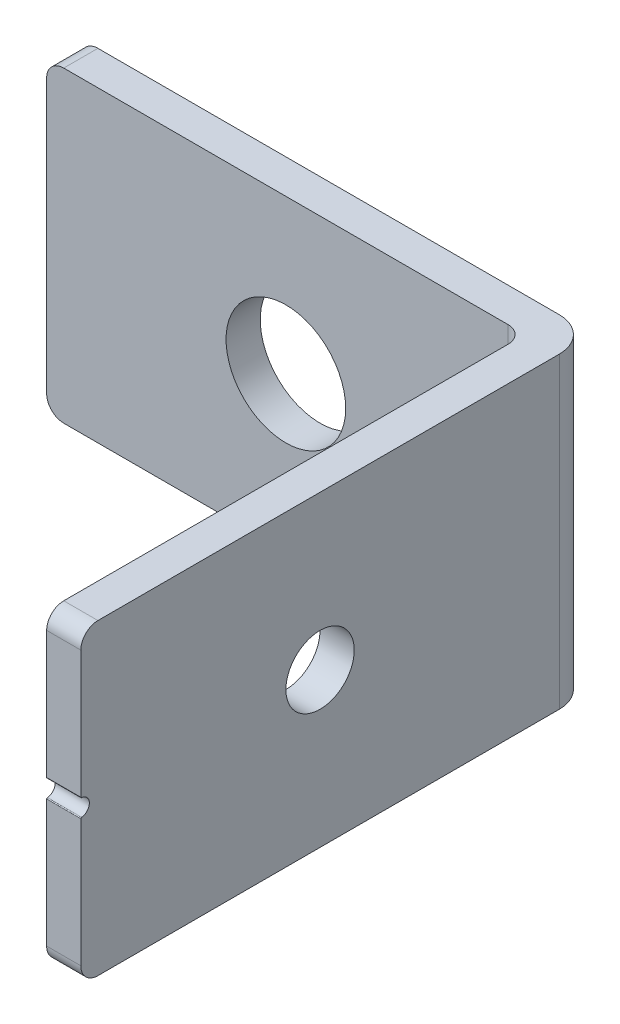
ISO-10303-21;
HEADER;
FILE_DESCRIPTION(('STEP AP214'),'2;1');
FILE_NAME('part.step','',(''),(''),'','','');
FILE_SCHEMA(('AUTOMOTIVE_DESIGN { 1 0 10303 214 1 1 1 1 }'));
ENDSEC;
DATA;
#1=APPLICATION_CONTEXT('core data for automotive mechanical design processes');
#2=APPLICATION_PROTOCOL_DEFINITION('international standard','automotive_design',2000,#1);
#3=PRODUCT_CONTEXT('',#1,'mechanical');
#4=PRODUCT('Part','Part','',(#3));
#5=PRODUCT_RELATED_PRODUCT_CATEGORY('part','',(#4));
#6=PRODUCT_DEFINITION_FORMATION('','',#4);
#7=PRODUCT_DEFINITION_CONTEXT('part definition',#1,'design');
#8=PRODUCT_DEFINITION('design','',#6,#7);
#9=PRODUCT_DEFINITION_SHAPE('','',#8);
#10=(LENGTH_UNIT() NAMED_UNIT(*) SI_UNIT(.MILLI.,.METRE.));
#11=(NAMED_UNIT(*) PLANE_ANGLE_UNIT() SI_UNIT($,.RADIAN.));
#12=(NAMED_UNIT(*) SI_UNIT($,.STERADIAN.) SOLID_ANGLE_UNIT());
#13=UNCERTAINTY_MEASURE_WITH_UNIT(LENGTH_MEASURE(1.E-05),#10,'distance_accuracy_value','');
#14=(GEOMETRIC_REPRESENTATION_CONTEXT(3) GLOBAL_UNCERTAINTY_ASSIGNED_CONTEXT((#13)) GLOBAL_UNIT_ASSIGNED_CONTEXT((#10,
#11,#12)) REPRESENTATION_CONTEXT('',''));
#15=CARTESIAN_POINT('',(0.,0.,0.));
#16=DIRECTION('',(0.,0.,1.));
#17=DIRECTION('',(1.,0.,0.));
#18=AXIS2_PLACEMENT_3D('',#15,#16,#17);
#19=CARTESIAN_POINT('',(25.348137020763,-15.23916015625,-30.));
#20=DIRECTION('',(-1.,0.,0.));
#21=DIRECTION('',(0.,0.,1.));
#22=AXIS2_PLACEMENT_3D('',#19,#20,#21);
#23=PLANE('',#22);
#24=CARTESIAN_POINT('',(25.348137020763,2.76083984375001,1.99999999999999));
#25=DIRECTION('',(-1.,0.,0.));
#26=DIRECTION('',(0.,0.,1.));
#27=AXIS2_PLACEMENT_3D('',#24,#25,#26);
#28=CIRCLE('',#27,4.);
#29=CARTESIAN_POINT('',(25.348137020763,2.76083984375001,5.99999999999999));
#30=VERTEX_POINT('',#29);
#31=EDGE_CURVE('E489',#30,#30,#28,.T.);
#32=ORIENTED_EDGE('',*,*,#31,.F.);
#33=EDGE_LOOP('',(#32));
#34=FACE_BOUND('',#33,.T.);
#35=DIRECTION('',(0.,-1.,0.));
#36=VECTOR('',#35,1.);
#37=CARTESIAN_POINT('',(25.348137020763,-15.23916015625,30.));
#38=LINE('',#37,#36);
#39=CARTESIAN_POINT('',(25.348137020763,1.66539472873947,30.));
#40=VERTEX_POINT('',#39);
#41=CARTESIAN_POINT('',(25.348137020763,-13.23916015625,30.));
#42=VERTEX_POINT('',#41);
#43=EDGE_CURVE('E226',#40,#42,#38,.T.);
#44=ORIENTED_EDGE('',*,*,#43,.F.);
#45=CARTESIAN_POINT('',(25.348137020763,1.66539472873947,29.9));
#46=DIRECTION('',(-1.,0.,0.));
#47=DIRECTION('',(0.,0.,1.));
#48=AXIS2_PLACEMENT_3D('',#45,#46,#47);
#49=CIRCLE('',#48,0.1);
#50=CARTESIAN_POINT('',(25.348137020763,1.76498064828587,29.9090909090909));
#51=VERTEX_POINT('',#50);
#52=EDGE_CURVE('E24',#40,#51,#49,.T.);
#53=ORIENTED_EDGE('',*,*,#52,.T.);
#54=CARTESIAN_POINT('',(25.348137020763,2.76083984375,30.));
#55=DIRECTION('',(-1.,0.,0.));
#56=DIRECTION('',(0.,0.,1.));
#57=AXIS2_PLACEMENT_3D('',#54,#55,#56);
#58=CIRCLE('',#57,1.0000000000002);
#59=CARTESIAN_POINT('',(25.348137020763,3.75669903921414,29.9090909090909));
#60=VERTEX_POINT('',#59);
#61=EDGE_CURVE('E225',#51,#60,#58,.F.);
#62=ORIENTED_EDGE('',*,*,#61,.T.);
#63=CARTESIAN_POINT('',(25.348137020763,3.85628495876053,29.9));
#64=DIRECTION('',(-1.,0.,0.));
#65=DIRECTION('',(0.,0.,1.));
#66=AXIS2_PLACEMENT_3D('',#63,#64,#65);
#67=CIRCLE('',#66,0.1);
#68=CARTESIAN_POINT('',(25.348137020763,3.85628495876053,30.));
#69=VERTEX_POINT('',#68);
#70=EDGE_CURVE('E31',#60,#69,#67,.T.);
#71=ORIENTED_EDGE('',*,*,#70,.T.);
#72=CARTESIAN_POINT('',(25.348137020763,18.76083984375,30.));
#73=VERTEX_POINT('',#72);
#74=EDGE_CURVE('E249',#73,#69,#38,.T.);
#75=ORIENTED_EDGE('',*,*,#74,.F.);
#76=CARTESIAN_POINT('',(25.348137020763,18.76083984375,28.));
#77=DIRECTION('',(-1.,0.,0.));
#78=DIRECTION('',(0.,0.,1.));
#79=AXIS2_PLACEMENT_3D('',#76,#77,#78);
#80=CIRCLE('',#79,2.);
#81=CARTESIAN_POINT('',(25.348137020763,20.76083984375,28.));
#82=VERTEX_POINT('',#81);
#83=EDGE_CURVE('E176',#73,#82,#80,.T.);
#84=ORIENTED_EDGE('',*,*,#83,.T.);
#85=DIRECTION('',(0.,0.,1.));
#86=VECTOR('',#85,1.);
#87=CARTESIAN_POINT('',(25.348137020763,20.76083984375,30.));
#88=LINE('',#87,#86);
#89=CARTESIAN_POINT('',(25.348137020763,20.76083984375,-24.));
#90=VERTEX_POINT('',#89);
#91=EDGE_CURVE('E245',#90,#82,#88,.T.);
#92=ORIENTED_EDGE('',*,*,#91,.F.);
#93=DIRECTION('',(0.,1.,0.));
#94=VECTOR('',#93,1.);
#95=CARTESIAN_POINT('',(25.348137020763,-15.23916015625,-24.));
#96=LINE('',#95,#94);
#97=CARTESIAN_POINT('',(25.348137020763,-15.23916015625,-24.));
#98=VERTEX_POINT('',#97);
#99=EDGE_CURVE('E181',#90,#98,#96,.F.);
#100=ORIENTED_EDGE('',*,*,#99,.T.);
#101=DIRECTION('',(0.,0.,-1.));
#102=VECTOR('',#101,1.);
#103=CARTESIAN_POINT('',(25.348137020763,-15.23916015625,-30.));
#104=LINE('',#103,#102);
#105=CARTESIAN_POINT('',(25.348137020763,-15.23916015625,28.));
#106=VERTEX_POINT('',#105);
#107=EDGE_CURVE('E241',#106,#98,#104,.T.);
#108=ORIENTED_EDGE('',*,*,#107,.F.);
#109=CARTESIAN_POINT('',(25.348137020763,-13.23916015625,28.));
#110=DIRECTION('',(-1.,0.,0.));
#111=DIRECTION('',(0.,0.,1.));
#112=AXIS2_PLACEMENT_3D('',#109,#110,#111);
#113=CIRCLE('',#112,2.);
#114=EDGE_CURVE('E178',#106,#42,#113,.T.);
#115=ORIENTED_EDGE('',*,*,#114,.T.);
#116=EDGE_LOOP('',(#44,#53,#62,#71,#75,#84,#92,#100,#108,#115));
#117=FACE_BOUND('',#116,.T.);
#118=ADVANCED_FACE('F16',(#34,#117),#23,.T.);
#119=CARTESIAN_POINT('',(29.348137020763,-15.23916015625,30.));
#120=DIRECTION('',(0.,0.,-1.));
#121=DIRECTION('',(-1.,0.,0.));
#122=AXIS2_PLACEMENT_3D('',#119,#120,#121);
#123=PLANE('',#122);
#124=ORIENTED_EDGE('',*,*,#74,.T.);
#125=DIRECTION('',(-1.,0.,0.));
#126=VECTOR('',#125,1.);
#127=CARTESIAN_POINT('',(29.348137020763,3.85628495876053,30.));
#128=LINE('',#127,#126);
#129=CARTESIAN_POINT('',(29.348137020763,3.85628495876053,30.));
#130=VERTEX_POINT('',#129);
#131=EDGE_CURVE('E10',#69,#130,#128,.F.);
#132=ORIENTED_EDGE('',*,*,#131,.T.);
#133=DIRECTION('',(0.,-1.,0.));
#134=VECTOR('',#133,1.);
#135=CARTESIAN_POINT('',(29.348137020763,-15.23916015625,30.));
#136=LINE('',#135,#134);
#137=CARTESIAN_POINT('',(29.348137020763,18.76083984375,30.));
#138=VERTEX_POINT('',#137);
#139=EDGE_CURVE('E146',#138,#130,#136,.T.);
#140=ORIENTED_EDGE('',*,*,#139,.F.);
#141=DIRECTION('',(-1.,0.,0.));
#142=VECTOR('',#141,1.);
#143=CARTESIAN_POINT('',(29.348137020763,18.76083984375,30.));
#144=LINE('',#143,#142);
#145=EDGE_CURVE('E193',#138,#73,#144,.T.);
#146=ORIENTED_EDGE('',*,*,#145,.T.);
#147=EDGE_LOOP('',(#124,#132,#140,#146));
#148=FACE_BOUND('',#147,.T.);
#149=ADVANCED_FACE('F313',(#148),#123,.F.);
#150=CARTESIAN_POINT('',(29.348137020763,1.66539472873947,30.));
#151=VERTEX_POINT('',#150);
#152=CARTESIAN_POINT('',(29.348137020763,-13.23916015625,30.));
#153=VERTEX_POINT('',#152);
#154=EDGE_CURVE('E235',#151,#153,#136,.T.);
#155=ORIENTED_EDGE('',*,*,#154,.F.);
#156=DIRECTION('',(-1.,0.,0.));
#157=VECTOR('',#156,1.);
#158=CARTESIAN_POINT('',(25.348137020763,1.66539472873947,30.));
#159=LINE('',#158,#157);
#160=EDGE_CURVE('E39',#151,#40,#159,.T.);
#161=ORIENTED_EDGE('',*,*,#160,.T.);
#162=ORIENTED_EDGE('',*,*,#43,.T.);
#163=DIRECTION('',(-1.,0.,0.));
#164=VECTOR('',#163,1.);
#165=CARTESIAN_POINT('',(29.348137020763,-13.23916015625,30.));
#166=LINE('',#165,#164);
#167=EDGE_CURVE('E187',#42,#153,#166,.F.);
#168=ORIENTED_EDGE('',*,*,#167,.T.);
#169=EDGE_LOOP('',(#155,#161,#162,#168));
#170=FACE_BOUND('',#169,.T.);
#171=ADVANCED_FACE('F236',(#170),#123,.F.);
#172=CARTESIAN_POINT('',(29.348137020763,-15.23916015625,-30.));
#173=DIRECTION('',(-1.,0.,0.));
#174=DIRECTION('',(0.,0.,1.));
#175=AXIS2_PLACEMENT_3D('',#172,#173,#174);
#176=PLANE('',#175);
#177=CARTESIAN_POINT('',(29.348137020763,2.76083984375001,1.99999999999999));
#178=DIRECTION('',(-1.,0.,0.));
#179=DIRECTION('',(0.,0.,1.));
#180=AXIS2_PLACEMENT_3D('',#177,#178,#179);
#181=CIRCLE('',#180,4.);
#182=CARTESIAN_POINT('',(29.348137020763,2.76083984375001,5.99999999999999));
#183=VERTEX_POINT('',#182);
#184=EDGE_CURVE('E248',#183,#183,#181,.T.);
#185=ORIENTED_EDGE('',*,*,#184,.T.);
#186=EDGE_LOOP('',(#185));
#187=FACE_BOUND('',#186,.T.);
#188=CARTESIAN_POINT('',(29.348137020763,2.76083984375,30.));
#189=DIRECTION('',(-1.,0.,0.));
#190=DIRECTION('',(0.,0.,1.));
#191=AXIS2_PLACEMENT_3D('',#188,#189,#190);
#192=CIRCLE('',#191,1.0000000000002);
#193=CARTESIAN_POINT('',(29.348137020763,1.76498064828587,29.9090909090909));
#194=VERTEX_POINT('',#193);
#195=CARTESIAN_POINT('',(29.348137020763,3.75669903921414,29.9090909090909));
#196=VERTEX_POINT('',#195);
#197=EDGE_CURVE('E161',#194,#196,#192,.F.);
#198=ORIENTED_EDGE('',*,*,#197,.F.);
#199=CARTESIAN_POINT('',(29.348137020763,1.66539472873947,29.9));
#200=DIRECTION('',(-1.,0.,0.));
#201=DIRECTION('',(0.,0.,1.));
#202=AXIS2_PLACEMENT_3D('',#199,#200,#201);
#203=CIRCLE('',#202,0.1);
#204=EDGE_CURVE('E220',#194,#151,#203,.F.);
#205=ORIENTED_EDGE('',*,*,#204,.T.);
#206=ORIENTED_EDGE('',*,*,#154,.T.);
#207=CARTESIAN_POINT('',(29.348137020763,-13.23916015625,28.));
#208=DIRECTION('',(-1.,0.,0.));
#209=DIRECTION('',(0.,0.,1.));
#210=AXIS2_PLACEMENT_3D('',#207,#208,#209);
#211=CIRCLE('',#210,2.);
#212=CARTESIAN_POINT('',(29.348137020763,-15.23916015625,28.));
#213=VERTEX_POINT('',#212);
#214=EDGE_CURVE('E141',#153,#213,#211,.F.);
#215=ORIENTED_EDGE('',*,*,#214,.T.);
#216=DIRECTION('',(0.,0.,-1.));
#217=VECTOR('',#216,1.);
#218=CARTESIAN_POINT('',(29.348137020763,-15.23916015625,-30.));
#219=LINE('',#218,#217);
#220=CARTESIAN_POINT('',(29.348137020763,-15.23916015625,-26.));
#221=VERTEX_POINT('',#220);
#222=EDGE_CURVE('E132',#213,#221,#219,.T.);
#223=ORIENTED_EDGE('',*,*,#222,.T.);
#224=DIRECTION('',(0.,1.,0.));
#225=VECTOR('',#224,1.);
#226=CARTESIAN_POINT('',(29.348137020763,20.76083984375,-26.));
#227=LINE('',#226,#225);
#228=CARTESIAN_POINT('',(29.348137020763,20.76083984375,-26.));
#229=VERTEX_POINT('',#228);
#230=EDGE_CURVE('E138',#221,#229,#227,.T.);
#231=ORIENTED_EDGE('',*,*,#230,.T.);
#232=DIRECTION('',(0.,0.,1.));
#233=VECTOR('',#232,1.);
#234=CARTESIAN_POINT('',(29.348137020763,20.76083984375,30.));
#235=LINE('',#234,#233);
#236=CARTESIAN_POINT('',(29.348137020763,20.76083984375,28.));
#237=VERTEX_POINT('',#236);
#238=EDGE_CURVE('E238',#229,#237,#235,.T.);
#239=ORIENTED_EDGE('',*,*,#238,.T.);
#240=CARTESIAN_POINT('',(29.348137020763,18.76083984375,28.));
#241=DIRECTION('',(-1.,0.,0.));
#242=DIRECTION('',(0.,0.,1.));
#243=AXIS2_PLACEMENT_3D('',#240,#241,#242);
#244=CIRCLE('',#243,2.);
#245=EDGE_CURVE('E190',#237,#138,#244,.F.);
#246=ORIENTED_EDGE('',*,*,#245,.T.);
#247=ORIENTED_EDGE('',*,*,#139,.T.);
#248=CARTESIAN_POINT('',(29.348137020763,3.85628495876053,29.9));
#249=DIRECTION('',(-1.,0.,0.));
#250=DIRECTION('',(0.,0.,1.));
#251=AXIS2_PLACEMENT_3D('',#248,#249,#250);
#252=CIRCLE('',#251,0.1);
#253=EDGE_CURVE('E218',#130,#196,#252,.F.);
#254=ORIENTED_EDGE('',*,*,#253,.T.);
#255=EDGE_LOOP('',(#198,#205,#206,#215,#223,#231,#239,#246,#247,#254));
#256=FACE_BOUND('',#255,.T.);
#257=ADVANCED_FACE('F135',(#187,#256),#176,.F.);
#258=CARTESIAN_POINT('',(25.348137020763,-15.23916015625,-26.));
#259=DIRECTION('',(0.,1.,0.));
#260=DIRECTION('',(-1.,0.,0.));
#261=AXIS2_PLACEMENT_3D('',#258,#259,#260);
#262=PLANE('',#261);
#263=ORIENTED_EDGE('',*,*,#222,.F.);
#264=DIRECTION('',(-1.,0.,0.));
#265=VECTOR('',#264,1.);
#266=CARTESIAN_POINT('',(25.348137020763,-15.23916015625,28.));
#267=LINE('',#266,#265);
#268=EDGE_CURVE('E185',#213,#106,#267,.T.);
#269=ORIENTED_EDGE('',*,*,#268,.T.);
#270=ORIENTED_EDGE('',*,*,#107,.T.);
#271=CARTESIAN_POINT('',(23.348137020763,-15.23916015625,-24.));
#272=DIRECTION('',(0.,1.,0.));
#273=DIRECTION('',(-1.,0.,0.));
#274=AXIS2_PLACEMENT_3D('',#271,#272,#273);
#275=CIRCLE('',#274,2.);
#276=CARTESIAN_POINT('',(23.348137020763,-15.23916015625,-26.));
#277=VERTEX_POINT('',#276);
#278=EDGE_CURVE('E211',#98,#277,#275,.T.);
#279=ORIENTED_EDGE('',*,*,#278,.T.);
#280=DIRECTION('',(1.,0.,0.));
#281=VECTOR('',#280,1.);
#282=CARTESIAN_POINT('',(25.348137020763,-15.23916015625,-26.));
#283=LINE('',#282,#281);
#284=CARTESIAN_POINT('',(-28.651862979237,-15.23916015625,-26.));
#285=VERTEX_POINT('',#284);
#286=EDGE_CURVE('E253',#285,#277,#283,.T.);
#287=ORIENTED_EDGE('',*,*,#286,.F.);
#288=DIRECTION('',(0.,0.,-1.));
#289=VECTOR('',#288,1.);
#290=CARTESIAN_POINT('',(-28.651862979237,-15.23916015625,-26.));
#291=LINE('',#290,#289);
#292=CARTESIAN_POINT('',(-28.651862979237,-15.23916015625,-30.));
#293=VERTEX_POINT('',#292);
#294=EDGE_CURVE('E183',#285,#293,#291,.T.);
#295=ORIENTED_EDGE('',*,*,#294,.T.);
#296=DIRECTION('',(1.,0.,0.));
#297=VECTOR('',#296,1.);
#298=CARTESIAN_POINT('',(25.348137020763,-15.23916015625,-30.));
#299=LINE('',#298,#297);
#300=CARTESIAN_POINT('',(25.348137020763,-15.23916015625,-30.));
#301=VERTEX_POINT('',#300);
#302=EDGE_CURVE('E145',#293,#301,#299,.T.);
#303=ORIENTED_EDGE('',*,*,#302,.T.);
#304=CARTESIAN_POINT('',(25.348137020763,-15.23916015625,-26.));
#305=DIRECTION('',(0.,1.,0.));
#306=DIRECTION('',(-1.,0.,0.));
#307=AXIS2_PLACEMENT_3D('',#304,#305,#306);
#308=CIRCLE('',#307,4.);
#309=EDGE_CURVE('E149',#301,#221,#308,.F.);
#310=ORIENTED_EDGE('',*,*,#309,.T.);
#311=EDGE_LOOP('',(#263,#269,#270,#279,#287,#295,#303,#310));
#312=FACE_BOUND('',#311,.T.);
#313=ADVANCED_FACE('F150',(#312),#262,.F.);
#314=CARTESIAN_POINT('',(-30.651862979237,20.76083984375,-26.));
#315=DIRECTION('',(0.,-1.,0.));
#316=DIRECTION('',(0.,0.,-1.));
#317=AXIS2_PLACEMENT_3D('',#314,#315,#316);
#318=PLANE('',#317);
#319=ORIENTED_EDGE('',*,*,#91,.T.);
#320=DIRECTION('',(-1.,0.,0.));
#321=VECTOR('',#320,1.);
#322=CARTESIAN_POINT('',(-30.651862979237,20.76083984375,28.));
#323=LINE('',#322,#321);
#324=EDGE_CURVE('E198',#82,#237,#323,.F.);
#325=ORIENTED_EDGE('',*,*,#324,.T.);
#326=ORIENTED_EDGE('',*,*,#238,.F.);
#327=CARTESIAN_POINT('',(25.348137020763,20.76083984375,-26.));
#328=DIRECTION('',(0.,-1.,0.));
#329=DIRECTION('',(0.,0.,-1.));
#330=AXIS2_PLACEMENT_3D('',#327,#328,#329);
#331=CIRCLE('',#330,4.);
#332=CARTESIAN_POINT('',(25.348137020763,20.76083984375,-30.));
#333=VERTEX_POINT('',#332);
#334=EDGE_CURVE('E160',#229,#333,#331,.F.);
#335=ORIENTED_EDGE('',*,*,#334,.T.);
#336=DIRECTION('',(-1.,0.,0.));
#337=VECTOR('',#336,1.);
#338=CARTESIAN_POINT('',(-30.651862979237,20.76083984375,-30.));
#339=LINE('',#338,#337);
#340=CARTESIAN_POINT('',(-28.651862979237,20.76083984375,-30.));
#341=VERTEX_POINT('',#340);
#342=EDGE_CURVE('E263',#333,#341,#339,.T.);
#343=ORIENTED_EDGE('',*,*,#342,.T.);
#344=DIRECTION('',(0.,0.,-1.));
#345=VECTOR('',#344,1.);
#346=CARTESIAN_POINT('',(-28.651862979237,20.76083984375,-26.));
#347=LINE('',#346,#345);
#348=CARTESIAN_POINT('',(-28.651862979237,20.76083984375,-26.));
#349=VERTEX_POINT('',#348);
#350=EDGE_CURVE('E196',#341,#349,#347,.F.);
#351=ORIENTED_EDGE('',*,*,#350,.T.);
#352=DIRECTION('',(-1.,0.,0.));
#353=VECTOR('',#352,1.);
#354=CARTESIAN_POINT('',(-30.651862979237,20.76083984375,-26.));
#355=LINE('',#354,#353);
#356=CARTESIAN_POINT('',(23.348137020763,20.76083984375,-26.));
#357=VERTEX_POINT('',#356);
#358=EDGE_CURVE('E256',#357,#349,#355,.T.);
#359=ORIENTED_EDGE('',*,*,#358,.F.);
#360=CARTESIAN_POINT('',(23.348137020763,20.76083984375,-24.));
#361=DIRECTION('',(0.,-1.,0.));
#362=DIRECTION('',(0.,0.,-1.));
#363=AXIS2_PLACEMENT_3D('',#360,#361,#362);
#364=CIRCLE('',#363,2.);
#365=EDGE_CURVE('E209',#357,#90,#364,.T.);
#366=ORIENTED_EDGE('',*,*,#365,.T.);
#367=EDGE_LOOP('',(#319,#325,#326,#335,#343,#351,#359,#366));
#368=FACE_BOUND('',#367,.T.);
#369=ADVANCED_FACE('F289',(#368),#318,.F.);
#370=CARTESIAN_POINT('',(-30.651862979237,-15.23916015625,-26.));
#371=DIRECTION('',(1.,0.,0.));
#372=DIRECTION('',(0.,0.,-1.));
#373=AXIS2_PLACEMENT_3D('',#370,#371,#372);
#374=PLANE('',#373);
#375=DIRECTION('',(0.,-1.,0.));
#376=VECTOR('',#375,1.);
#377=CARTESIAN_POINT('',(-30.651862979237,-15.23916015625,-26.));
#378=LINE('',#377,#376);
#379=CARTESIAN_POINT('',(-30.651862979237,18.76083984375,-26.));
#380=VERTEX_POINT('',#379);
#381=CARTESIAN_POINT('',(-30.651862979237,-13.23916015625,-26.));
#382=VERTEX_POINT('',#381);
#383=EDGE_CURVE('E165',#380,#382,#378,.T.);
#384=ORIENTED_EDGE('',*,*,#383,.F.);
#385=DIRECTION('',(0.,0.,-1.));
#386=VECTOR('',#385,1.);
#387=CARTESIAN_POINT('',(-30.651862979237,18.76083984375,-26.));
#388=LINE('',#387,#386);
#389=CARTESIAN_POINT('',(-30.651862979237,18.76083984375,-30.));
#390=VERTEX_POINT('',#389);
#391=EDGE_CURVE('E202',#380,#390,#388,.T.);
#392=ORIENTED_EDGE('',*,*,#391,.T.);
#393=DIRECTION('',(0.,-1.,0.));
#394=VECTOR('',#393,1.);
#395=CARTESIAN_POINT('',(-30.651862979237,-15.23916015625,-30.));
#396=LINE('',#395,#394);
#397=CARTESIAN_POINT('',(-30.651862979237,-13.23916015625,-30.));
#398=VERTEX_POINT('',#397);
#399=EDGE_CURVE('E257',#390,#398,#396,.T.);
#400=ORIENTED_EDGE('',*,*,#399,.T.);
#401=DIRECTION('',(0.,0.,-1.));
#402=VECTOR('',#401,1.);
#403=CARTESIAN_POINT('',(-30.651862979237,-13.23916015625,-26.));
#404=LINE('',#403,#402);
#405=EDGE_CURVE('E200',#398,#382,#404,.F.);
#406=ORIENTED_EDGE('',*,*,#405,.T.);
#407=EDGE_LOOP('',(#384,#392,#400,#406));
#408=FACE_BOUND('',#407,.T.);
#409=ADVANCED_FACE('F270',(#408),#374,.F.);
#410=CARTESIAN_POINT('',(-30.651862979237,-15.23916015625,-26.));
#411=DIRECTION('',(0.,0.,-1.));
#412=DIRECTION('',(-1.,0.,0.));
#413=AXIS2_PLACEMENT_3D('',#410,#411,#412);
#414=PLANE('',#413);
#415=CARTESIAN_POINT('',(-2.65186297923697,2.76083984375,-26.));
#416=DIRECTION('',(0.,0.,1.));
#417=DIRECTION('',(1.,0.,0.));
#418=AXIS2_PLACEMENT_3D('',#415,#416,#417);
#419=CIRCLE('',#418,7.00000000000001);
#420=CARTESIAN_POINT('',(4.34813702076304,2.76083984375,-26.));
#421=VERTEX_POINT('',#420);
#422=EDGE_CURVE('E232',#421,#421,#419,.T.);
#423=ORIENTED_EDGE('',*,*,#422,.F.);
#424=EDGE_LOOP('',(#423));
#425=FACE_BOUND('',#424,.T.);
#426=ORIENTED_EDGE('',*,*,#286,.T.);
#427=DIRECTION('',(0.,1.,0.));
#428=VECTOR('',#427,1.);
#429=CARTESIAN_POINT('',(23.348137020763,-15.23916015625,-26.));
#430=LINE('',#429,#428);
#431=EDGE_CURVE('E173',#277,#357,#430,.T.);
#432=ORIENTED_EDGE('',*,*,#431,.T.);
#433=ORIENTED_EDGE('',*,*,#358,.T.);
#434=CARTESIAN_POINT('',(-28.651862979237,18.76083984375,-26.));
#435=DIRECTION('',(0.,0.,-1.));
#436=DIRECTION('',(-1.,0.,0.));
#437=AXIS2_PLACEMENT_3D('',#434,#435,#436);
#438=CIRCLE('',#437,2.);
#439=EDGE_CURVE('E171',#349,#380,#438,.F.);
#440=ORIENTED_EDGE('',*,*,#439,.T.);
#441=ORIENTED_EDGE('',*,*,#383,.T.);
#442=CARTESIAN_POINT('',(-28.651862979237,-13.23916015625,-26.));
#443=DIRECTION('',(0.,0.,-1.));
#444=DIRECTION('',(-1.,0.,0.));
#445=AXIS2_PLACEMENT_3D('',#442,#443,#444);
#446=CIRCLE('',#445,2.);
#447=EDGE_CURVE('E156',#382,#285,#446,.F.);
#448=ORIENTED_EDGE('',*,*,#447,.T.);
#449=EDGE_LOOP('',(#426,#432,#433,#440,#441,#448));
#450=FACE_BOUND('',#449,.T.);
#451=ADVANCED_FACE('F279',(#425,#450),#414,.F.);
#452=CARTESIAN_POINT('',(-30.651862979237,-15.23916015625,-30.));
#453=DIRECTION('',(0.,0.,-1.));
#454=DIRECTION('',(-1.,0.,0.));
#455=AXIS2_PLACEMENT_3D('',#452,#453,#454);
#456=PLANE('',#455);
#457=CARTESIAN_POINT('',(-2.65186297923697,2.76083984375,-30.));
#458=DIRECTION('',(0.,0.,1.));
#459=DIRECTION('',(1.,0.,0.));
#460=AXIS2_PLACEMENT_3D('',#457,#458,#459);
#461=CIRCLE('',#460,7.00000000000001);
#462=CARTESIAN_POINT('',(4.34813702076304,2.76083984375,-30.));
#463=VERTEX_POINT('',#462);
#464=EDGE_CURVE('E485',#463,#463,#461,.T.);
#465=ORIENTED_EDGE('',*,*,#464,.T.);
#466=EDGE_LOOP('',(#465));
#467=FACE_BOUND('',#466,.T.);
#468=ORIENTED_EDGE('',*,*,#399,.F.);
#469=CARTESIAN_POINT('',(-28.651862979237,18.76083984375,-30.));
#470=DIRECTION('',(0.,0.,-1.));
#471=DIRECTION('',(-1.,0.,0.));
#472=AXIS2_PLACEMENT_3D('',#469,#470,#471);
#473=CIRCLE('',#472,2.);
#474=EDGE_CURVE('E207',#390,#341,#473,.T.);
#475=ORIENTED_EDGE('',*,*,#474,.T.);
#476=ORIENTED_EDGE('',*,*,#342,.F.);
#477=DIRECTION('',(0.,1.,0.));
#478=VECTOR('',#477,1.);
#479=CARTESIAN_POINT('',(25.348137020763,-15.23916015625,-30.));
#480=LINE('',#479,#478);
#481=EDGE_CURVE('E157',#333,#301,#480,.F.);
#482=ORIENTED_EDGE('',*,*,#481,.T.);
#483=ORIENTED_EDGE('',*,*,#302,.F.);
#484=CARTESIAN_POINT('',(-28.651862979237,-13.23916015625,-30.));
#485=DIRECTION('',(0.,0.,-1.));
#486=DIRECTION('',(-1.,0.,0.));
#487=AXIS2_PLACEMENT_3D('',#484,#485,#486);
#488=CIRCLE('',#487,2.);
#489=EDGE_CURVE('E205',#293,#398,#488,.T.);
#490=ORIENTED_EDGE('',*,*,#489,.T.);
#491=EDGE_LOOP('',(#468,#475,#476,#482,#483,#490));
#492=FACE_BOUND('',#491,.T.);
#493=ADVANCED_FACE('F295',(#467,#492),#456,.T.);
#494=CARTESIAN_POINT('',(29.348137020763,2.76083984375001,1.99999999999999));
#495=DIRECTION('',(-1.,0.,0.));
#496=DIRECTION('',(0.,0.,1.));
#497=AXIS2_PLACEMENT_3D('',#494,#495,#496);
#498=CYLINDRICAL_SURFACE('',#497,4.);
#499=ORIENTED_EDGE('',*,*,#184,.F.);
#500=EDGE_LOOP('',(#499));
#501=FACE_BOUND('',#500,.T.);
#502=ORIENTED_EDGE('',*,*,#31,.T.);
#503=EDGE_LOOP('',(#502));
#504=FACE_BOUND('',#503,.T.);
#505=ADVANCED_FACE('F297',(#501,#504),#498,.F.);
#506=CARTESIAN_POINT('',(-2.65186297923697,2.76083984375,-30.));
#507=DIRECTION('',(0.,0.,1.));
#508=DIRECTION('',(1.,0.,0.));
#509=AXIS2_PLACEMENT_3D('',#506,#507,#508);
#510=CYLINDRICAL_SURFACE('',#509,7.00000000000001);
#511=ORIENTED_EDGE('',*,*,#464,.F.);
#512=EDGE_LOOP('',(#511));
#513=FACE_BOUND('',#512,.T.);
#514=ORIENTED_EDGE('',*,*,#422,.T.);
#515=EDGE_LOOP('',(#514));
#516=FACE_BOUND('',#515,.T.);
#517=ADVANCED_FACE('F305',(#513,#516),#510,.F.);
#518=CARTESIAN_POINT('',(-94.8690491972661,2.76083984375,30.));
#519=DIRECTION('',(1.,0.,0.));
#520=DIRECTION('',(0.,0.,-1.));
#521=AXIS2_PLACEMENT_3D('',#518,#519,#520);
#522=CYLINDRICAL_SURFACE('',#521,1.0000000000002);
#523=ORIENTED_EDGE('',*,*,#61,.F.);
#524=DIRECTION('',(1.,0.,0.));
#525=VECTOR('',#524,1.);
#526=CARTESIAN_POINT('',(-94.8690491972661,1.76498064828587,29.9090909090909));
#527=LINE('',#526,#525);
#528=EDGE_CURVE('E215',#51,#194,#527,.T.);
#529=ORIENTED_EDGE('',*,*,#528,.T.);
#530=ORIENTED_EDGE('',*,*,#197,.T.);
#531=DIRECTION('',(1.,0.,0.));
#532=VECTOR('',#531,1.);
#533=CARTESIAN_POINT('',(-94.8690491972661,3.75669903921414,29.9090909090909));
#534=LINE('',#533,#532);
#535=EDGE_CURVE('E213',#196,#60,#534,.F.);
#536=ORIENTED_EDGE('',*,*,#535,.T.);
#537=EDGE_LOOP('',(#523,#529,#530,#536));
#538=FACE_BOUND('',#537,.T.);
#539=ADVANCED_FACE('F230',(#538),#522,.F.);
#540=CARTESIAN_POINT('',(25.348137020763,-15.23916015625,-26.));
#541=DIRECTION('',(0.,-1.,0.));
#542=DIRECTION('',(0.,0.,-1.));
#543=AXIS2_PLACEMENT_3D('',#540,#541,#542);
#544=CYLINDRICAL_SURFACE('',#543,4.);
#545=ORIENTED_EDGE('',*,*,#309,.F.);
#546=ORIENTED_EDGE('',*,*,#481,.F.);
#547=ORIENTED_EDGE('',*,*,#334,.F.);
#548=ORIENTED_EDGE('',*,*,#230,.F.);
#549=EDGE_LOOP('',(#545,#546,#547,#548));
#550=FACE_BOUND('',#549,.T.);
#551=ADVANCED_FACE('F159',(#550),#544,.T.);
#552=CARTESIAN_POINT('',(23.348137020763,-15.23916015625,-24.));
#553=DIRECTION('',(0.,1.,0.));
#554=DIRECTION('',(0.,0.,1.));
#555=AXIS2_PLACEMENT_3D('',#552,#553,#554);
#556=CYLINDRICAL_SURFACE('',#555,2.);
#557=ORIENTED_EDGE('',*,*,#278,.F.);
#558=ORIENTED_EDGE('',*,*,#99,.F.);
#559=ORIENTED_EDGE('',*,*,#365,.F.);
#560=ORIENTED_EDGE('',*,*,#431,.F.);
#561=EDGE_LOOP('',(#557,#558,#559,#560));
#562=FACE_BOUND('',#561,.T.);
#563=ADVANCED_FACE('F285',(#562),#556,.F.);
#564=CARTESIAN_POINT('',(25.348137020763,-13.23916015625,28.));
#565=DIRECTION('',(-1.,0.,0.));
#566=DIRECTION('',(0.,-1.,0.));
#567=AXIS2_PLACEMENT_3D('',#564,#565,#566);
#568=CYLINDRICAL_SURFACE('',#567,2.);
#569=ORIENTED_EDGE('',*,*,#214,.F.);
#570=ORIENTED_EDGE('',*,*,#167,.F.);
#571=ORIENTED_EDGE('',*,*,#114,.F.);
#572=ORIENTED_EDGE('',*,*,#268,.F.);
#573=EDGE_LOOP('',(#569,#570,#571,#572));
#574=FACE_BOUND('',#573,.T.);
#575=ADVANCED_FACE('F337',(#574),#568,.T.);
#576=CARTESIAN_POINT('',(29.348137020763,18.76083984375,28.));
#577=DIRECTION('',(-1.,0.,0.));
#578=DIRECTION('',(0.,0.,1.));
#579=AXIS2_PLACEMENT_3D('',#576,#577,#578);
#580=CYLINDRICAL_SURFACE('',#579,2.);
#581=ORIENTED_EDGE('',*,*,#245,.F.);
#582=ORIENTED_EDGE('',*,*,#324,.F.);
#583=ORIENTED_EDGE('',*,*,#83,.F.);
#584=ORIENTED_EDGE('',*,*,#145,.F.);
#585=EDGE_LOOP('',(#581,#582,#583,#584));
#586=FACE_BOUND('',#585,.T.);
#587=ADVANCED_FACE('F344',(#586),#580,.T.);
#588=CARTESIAN_POINT('',(-28.651862979237,18.76083984375,-26.));
#589=DIRECTION('',(0.,0.,-1.));
#590=DIRECTION('',(-1.,0.,0.));
#591=AXIS2_PLACEMENT_3D('',#588,#589,#590);
#592=CYLINDRICAL_SURFACE('',#591,2.);
#593=ORIENTED_EDGE('',*,*,#439,.F.);
#594=ORIENTED_EDGE('',*,*,#350,.F.);
#595=ORIENTED_EDGE('',*,*,#474,.F.);
#596=ORIENTED_EDGE('',*,*,#391,.F.);
#597=EDGE_LOOP('',(#593,#594,#595,#596));
#598=FACE_BOUND('',#597,.T.);
#599=ADVANCED_FACE('F294',(#598),#592,.T.);
#600=CARTESIAN_POINT('',(-28.651862979237,-13.23916015625,-26.));
#601=DIRECTION('',(0.,0.,-1.));
#602=DIRECTION('',(-1.,0.,0.));
#603=AXIS2_PLACEMENT_3D('',#600,#601,#602);
#604=CYLINDRICAL_SURFACE('',#603,2.);
#605=ORIENTED_EDGE('',*,*,#447,.F.);
#606=ORIENTED_EDGE('',*,*,#405,.F.);
#607=ORIENTED_EDGE('',*,*,#489,.F.);
#608=ORIENTED_EDGE('',*,*,#294,.F.);
#609=EDGE_LOOP('',(#605,#606,#607,#608));
#610=FACE_BOUND('',#609,.T.);
#611=ADVANCED_FACE('F275',(#610),#604,.T.);
#612=CARTESIAN_POINT('',(-94.8690491972661,1.66539472873947,29.9));
#613=DIRECTION('',(1.,0.,0.));
#614=DIRECTION('',(0.,0.,-1.));
#615=AXIS2_PLACEMENT_3D('',#612,#613,#614);
#616=CYLINDRICAL_SURFACE('',#615,0.1);
#617=ORIENTED_EDGE('',*,*,#52,.F.);
#618=ORIENTED_EDGE('',*,*,#160,.F.);
#619=ORIENTED_EDGE('',*,*,#204,.F.);
#620=ORIENTED_EDGE('',*,*,#528,.F.);
#621=EDGE_LOOP('',(#617,#618,#619,#620));
#622=FACE_BOUND('',#621,.T.);
#623=ADVANCED_FACE('F234',(#622),#616,.T.);
#624=CARTESIAN_POINT('',(-94.8690491972661,3.85628495876053,29.9));
#625=DIRECTION('',(1.,0.,0.));
#626=DIRECTION('',(0.,0.,-1.));
#627=AXIS2_PLACEMENT_3D('',#624,#625,#626);
#628=CYLINDRICAL_SURFACE('',#627,0.1);
#629=ORIENTED_EDGE('',*,*,#70,.F.);
#630=ORIENTED_EDGE('',*,*,#535,.F.);
#631=ORIENTED_EDGE('',*,*,#253,.F.);
#632=ORIENTED_EDGE('',*,*,#131,.F.);
#633=EDGE_LOOP('',(#629,#630,#631,#632));
#634=FACE_BOUND('',#633,.T.);
#635=ADVANCED_FACE('F18',(#634),#628,.T.);
#636=CLOSED_SHELL('',(#118,#149,#171,#257,#313,#369,#409,#451,#493,#505,#517,#539,#551,#563,
#575,#587,#599,#611,#623,#635));
#637=MANIFOLD_SOLID_BREP('B1',#636);
#638=ADVANCED_BREP_SHAPE_REPRESENTATION('',(#18,#637),#14);
#639=SHAPE_DEFINITION_REPRESENTATION(#9,#638);
ENDSEC;
END-ISO-10303-21;
